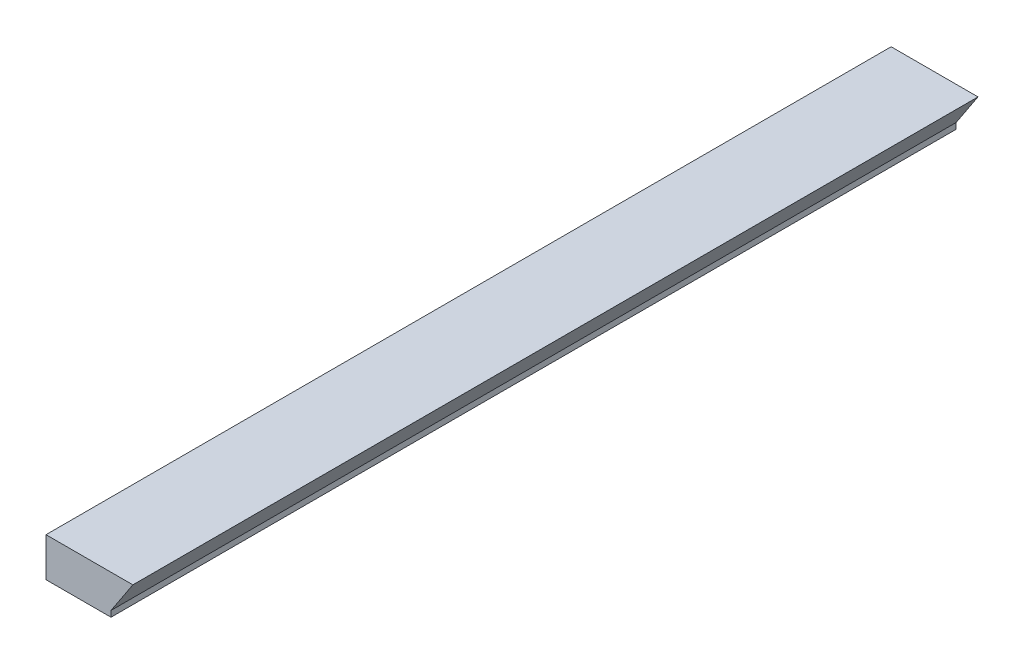
ISO-10303-21;
HEADER;
FILE_DESCRIPTION(('STEP AP214'),'2;1');
FILE_NAME('part.step','',(''),(''),'','','');
FILE_SCHEMA(('AUTOMOTIVE_DESIGN { 1 0 10303 214 1 1 1 1 }'));
ENDSEC;
DATA;
#1=APPLICATION_CONTEXT('core data for automotive mechanical design processes');
#2=APPLICATION_PROTOCOL_DEFINITION('international standard','automotive_design',2000,#1);
#3=PRODUCT_CONTEXT('',#1,'mechanical');
#4=PRODUCT('Part','Part','',(#3));
#5=PRODUCT_RELATED_PRODUCT_CATEGORY('part','',(#4));
#6=PRODUCT_DEFINITION_FORMATION('','',#4);
#7=PRODUCT_DEFINITION_CONTEXT('part definition',#1,'design');
#8=PRODUCT_DEFINITION('design','',#6,#7);
#9=PRODUCT_DEFINITION_SHAPE('','',#8);
#10=(LENGTH_UNIT() NAMED_UNIT(*) SI_UNIT(.MILLI.,.METRE.));
#11=(NAMED_UNIT(*) PLANE_ANGLE_UNIT() SI_UNIT($,.RADIAN.));
#12=(NAMED_UNIT(*) SI_UNIT($,.STERADIAN.) SOLID_ANGLE_UNIT());
#13=UNCERTAINTY_MEASURE_WITH_UNIT(LENGTH_MEASURE(1.E-05),#10,'distance_accuracy_value','');
#14=(GEOMETRIC_REPRESENTATION_CONTEXT(3) GLOBAL_UNCERTAINTY_ASSIGNED_CONTEXT((#13)) GLOBAL_UNIT_ASSIGNED_CONTEXT((#10,
#11,#12)) REPRESENTATION_CONTEXT('',''));
#15=CARTESIAN_POINT('',(0.,0.,0.));
#16=DIRECTION('',(0.,0.,1.));
#17=DIRECTION('',(1.,0.,0.));
#18=AXIS2_PLACEMENT_3D('',#15,#16,#17);
#19=CARTESIAN_POINT('',(0.,0.,65.));
#20=DIRECTION('',(0.,1.,0.));
#21=DIRECTION('',(-1.,0.,0.));
#22=AXIS2_PLACEMENT_3D('',#19,#20,#21);
#23=PLANE('',#22);
#24=DIRECTION('',(1.,0.,0.));
#25=VECTOR('',#24,1.);
#26=CARTESIAN_POINT('',(0.,0.,0.));
#27=LINE('',#26,#25);
#28=CARTESIAN_POINT('',(-5.,0.,0.));
#29=VERTEX_POINT('',#28);
#30=CARTESIAN_POINT('',(0.,0.,0.));
#31=VERTEX_POINT('',#30);
#32=EDGE_CURVE('E107',#29,#31,#27,.T.);
#33=ORIENTED_EDGE('',*,*,#32,.T.);
#34=DIRECTION('',(0.,0.,-1.));
#35=VECTOR('',#34,1.);
#36=CARTESIAN_POINT('',(0.,0.,65.));
#37=LINE('',#36,#35);
#38=CARTESIAN_POINT('',(0.,0.,65.));
#39=VERTEX_POINT('',#38);
#40=EDGE_CURVE('E11',#39,#31,#37,.T.);
#41=ORIENTED_EDGE('',*,*,#40,.F.);
#42=DIRECTION('',(1.,0.,0.));
#43=VECTOR('',#42,1.);
#44=CARTESIAN_POINT('',(0.,0.,65.));
#45=LINE('',#44,#43);
#46=CARTESIAN_POINT('',(-5.,0.,65.));
#47=VERTEX_POINT('',#46);
#48=EDGE_CURVE('E115',#47,#39,#45,.T.);
#49=ORIENTED_EDGE('',*,*,#48,.F.);
#50=DIRECTION('',(0.,0.,-1.));
#51=VECTOR('',#50,1.);
#52=CARTESIAN_POINT('',(-5.,0.,65.));
#53=LINE('',#52,#51);
#54=EDGE_CURVE('E103',#47,#29,#53,.T.);
#55=ORIENTED_EDGE('',*,*,#54,.T.);
#56=EDGE_LOOP('',(#33,#41,#49,#55));
#57=FACE_BOUND('',#56,.T.);
#58=ADVANCED_FACE('F33',(#57),#23,.F.);
#59=CARTESIAN_POINT('',(0.,0.453850478810611,65.));
#60=DIRECTION('',(-1.,0.,0.));
#61=DIRECTION('',(0.,-1.,0.));
#62=AXIS2_PLACEMENT_3D('',#59,#60,#61);
#63=PLANE('',#62);
#64=DIRECTION('',(0.,1.,0.));
#65=VECTOR('',#64,1.);
#66=CARTESIAN_POINT('',(0.,0.453850478810611,0.));
#67=LINE('',#66,#65);
#68=CARTESIAN_POINT('',(0.,0.453850478810611,0.));
#69=VERTEX_POINT('',#68);
#70=EDGE_CURVE('E110',#31,#69,#67,.T.);
#71=ORIENTED_EDGE('',*,*,#70,.T.);
#72=DIRECTION('',(0.,0.,-1.));
#73=VECTOR('',#72,1.);
#74=CARTESIAN_POINT('',(0.,0.453850478810611,65.));
#75=LINE('',#74,#73);
#76=CARTESIAN_POINT('',(0.,0.453850478810611,65.));
#77=VERTEX_POINT('',#76);
#78=EDGE_CURVE('E41',#77,#69,#75,.T.);
#79=ORIENTED_EDGE('',*,*,#78,.F.);
#80=DIRECTION('',(0.,1.,0.));
#81=VECTOR('',#80,1.);
#82=CARTESIAN_POINT('',(0.,0.453850478810611,65.));
#83=LINE('',#82,#81);
#84=EDGE_CURVE('E82',#39,#77,#83,.T.);
#85=ORIENTED_EDGE('',*,*,#84,.F.);
#86=ORIENTED_EDGE('',*,*,#40,.T.);
#87=EDGE_LOOP('',(#71,#79,#85,#86));
#88=FACE_BOUND('',#87,.T.);
#89=ADVANCED_FACE('F134',(#88),#63,.F.);
#90=CARTESIAN_POINT('',(1.680458683985,3.,65.));
#91=DIRECTION('',(-0.834609406561725,0.550842208330739,0.));
#92=DIRECTION('',(-0.550842208330739,-0.834609406561725,0.));
#93=AXIS2_PLACEMENT_3D('',#90,#91,#92);
#94=PLANE('',#93);
#95=DIRECTION('',(0.550842208330739,0.834609406561725,0.));
#96=VECTOR('',#95,1.);
#97=CARTESIAN_POINT('',(1.680458683985,3.,0.));
#98=LINE('',#97,#96);
#99=CARTESIAN_POINT('',(1.680458683985,3.,0.));
#100=VERTEX_POINT('',#99);
#101=EDGE_CURVE('E98',#69,#100,#98,.T.);
#102=ORIENTED_EDGE('',*,*,#101,.T.);
#103=DIRECTION('',(0.,0.,-1.));
#104=VECTOR('',#103,1.);
#105=CARTESIAN_POINT('',(1.680458683985,3.,65.));
#106=LINE('',#105,#104);
#107=CARTESIAN_POINT('',(1.680458683985,3.,65.));
#108=VERTEX_POINT('',#107);
#109=EDGE_CURVE('E95',#108,#100,#106,.T.);
#110=ORIENTED_EDGE('',*,*,#109,.F.);
#111=DIRECTION('',(0.550842208330739,0.834609406561725,0.));
#112=VECTOR('',#111,1.);
#113=CARTESIAN_POINT('',(1.680458683985,3.,65.));
#114=LINE('',#113,#112);
#115=EDGE_CURVE('E86',#77,#108,#114,.T.);
#116=ORIENTED_EDGE('',*,*,#115,.F.);
#117=ORIENTED_EDGE('',*,*,#78,.T.);
#118=EDGE_LOOP('',(#102,#110,#116,#117));
#119=FACE_BOUND('',#118,.T.);
#120=ADVANCED_FACE('F96',(#119),#94,.F.);
#121=CARTESIAN_POINT('',(-5.,3.,65.));
#122=DIRECTION('',(0.,-1.,0.));
#123=DIRECTION('',(0.,0.,-1.));
#124=AXIS2_PLACEMENT_3D('',#121,#122,#123);
#125=PLANE('',#124);
#126=DIRECTION('',(-1.,0.,0.));
#127=VECTOR('',#126,1.);
#128=CARTESIAN_POINT('',(-5.,3.,0.));
#129=LINE('',#128,#127);
#130=CARTESIAN_POINT('',(-5.,3.,0.));
#131=VERTEX_POINT('',#130);
#132=EDGE_CURVE('E68',#100,#131,#129,.T.);
#133=ORIENTED_EDGE('',*,*,#132,.T.);
#134=DIRECTION('',(0.,0.,-1.));
#135=VECTOR('',#134,1.);
#136=CARTESIAN_POINT('',(-5.,3.,65.));
#137=LINE('',#136,#135);
#138=CARTESIAN_POINT('',(-5.,3.,65.));
#139=VERTEX_POINT('',#138);
#140=EDGE_CURVE('E99',#139,#131,#137,.T.);
#141=ORIENTED_EDGE('',*,*,#140,.F.);
#142=DIRECTION('',(-1.,0.,0.));
#143=VECTOR('',#142,1.);
#144=CARTESIAN_POINT('',(0.,3.,65.));
#145=LINE('',#144,#143);
#146=EDGE_CURVE('E90',#108,#139,#145,.T.);
#147=ORIENTED_EDGE('',*,*,#146,.F.);
#148=ORIENTED_EDGE('',*,*,#109,.T.);
#149=EDGE_LOOP('',(#133,#141,#147,#148));
#150=FACE_BOUND('',#149,.T.);
#151=ADVANCED_FACE('F101',(#150),#125,.F.);
#152=CARTESIAN_POINT('',(-5.,0.,65.));
#153=DIRECTION('',(1.,0.,0.));
#154=DIRECTION('',(0.,0.,-1.));
#155=AXIS2_PLACEMENT_3D('',#152,#153,#154);
#156=PLANE('',#155);
#157=DIRECTION('',(0.,-1.,0.));
#158=VECTOR('',#157,1.);
#159=CARTESIAN_POINT('',(-5.,0.,0.));
#160=LINE('',#159,#158);
#161=EDGE_CURVE('E74',#131,#29,#160,.T.);
#162=ORIENTED_EDGE('',*,*,#161,.T.);
#163=ORIENTED_EDGE('',*,*,#54,.F.);
#164=DIRECTION('',(0.,-1.,0.));
#165=VECTOR('',#164,1.);
#166=CARTESIAN_POINT('',(-5.,0.,65.));
#167=LINE('',#166,#165);
#168=EDGE_CURVE('E49',#139,#47,#167,.T.);
#169=ORIENTED_EDGE('',*,*,#168,.F.);
#170=ORIENTED_EDGE('',*,*,#140,.T.);
#171=EDGE_LOOP('',(#162,#163,#169,#170));
#172=FACE_BOUND('',#171,.T.);
#173=ADVANCED_FACE('F123',(#172),#156,.F.);
#174=CARTESIAN_POINT('',(0.,0.,65.));
#175=DIRECTION('',(0.,0.,-1.));
#176=DIRECTION('',(-1.,0.,0.));
#177=AXIS2_PLACEMENT_3D('',#174,#175,#176);
#178=PLANE('',#177);
#179=ORIENTED_EDGE('',*,*,#48,.T.);
#180=ORIENTED_EDGE('',*,*,#84,.T.);
#181=ORIENTED_EDGE('',*,*,#115,.T.);
#182=ORIENTED_EDGE('',*,*,#146,.T.);
#183=ORIENTED_EDGE('',*,*,#168,.T.);
#184=EDGE_LOOP('',(#179,#180,#181,#182,#183));
#185=FACE_BOUND('',#184,.T.);
#186=ADVANCED_FACE('F88',(#185),#178,.F.);
#187=CARTESIAN_POINT('',(0.,0.,0.));
#188=DIRECTION('',(0.,0.,-1.));
#189=DIRECTION('',(-1.,0.,0.));
#190=AXIS2_PLACEMENT_3D('',#187,#188,#189);
#191=PLANE('',#190);
#192=ORIENTED_EDGE('',*,*,#32,.F.);
#193=ORIENTED_EDGE('',*,*,#161,.F.);
#194=ORIENTED_EDGE('',*,*,#132,.F.);
#195=ORIENTED_EDGE('',*,*,#101,.F.);
#196=ORIENTED_EDGE('',*,*,#70,.F.);
#197=EDGE_LOOP('',(#192,#193,#194,#195,#196));
#198=FACE_BOUND('',#197,.T.);
#199=ADVANCED_FACE('F119',(#198),#191,.T.);
#200=CLOSED_SHELL('',(#58,#89,#120,#151,#173,#186,#199));
#201=MANIFOLD_SOLID_BREP('B2',#200);
#202=ADVANCED_BREP_SHAPE_REPRESENTATION('',(#18,#201),#14);
#203=SHAPE_DEFINITION_REPRESENTATION(#9,#202);
ENDSEC;
END-ISO-10303-21;
